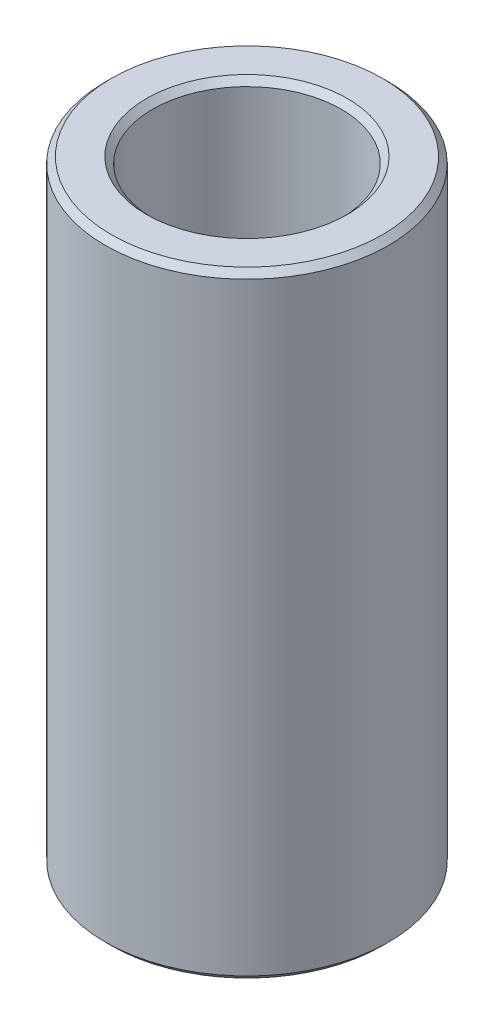
ISO-10303-21;
HEADER;
FILE_DESCRIPTION(('STEP AP214'),'2;1');
FILE_NAME('part.step','',(''),(''),'','','');
FILE_SCHEMA(('AUTOMOTIVE_DESIGN { 1 0 10303 214 1 1 1 1 }'));
ENDSEC;
DATA;
#1=APPLICATION_CONTEXT('core data for automotive mechanical design processes');
#2=APPLICATION_PROTOCOL_DEFINITION('international standard','automotive_design',2000,#1);
#3=PRODUCT_CONTEXT('',#1,'mechanical');
#4=PRODUCT('Part','Part','',(#3));
#5=PRODUCT_RELATED_PRODUCT_CATEGORY('part','',(#4));
#6=PRODUCT_DEFINITION_FORMATION('','',#4);
#7=PRODUCT_DEFINITION_CONTEXT('part definition',#1,'design');
#8=PRODUCT_DEFINITION('design','',#6,#7);
#9=PRODUCT_DEFINITION_SHAPE('','',#8);
#10=(LENGTH_UNIT() NAMED_UNIT(*) SI_UNIT(.MILLI.,.METRE.));
#11=(NAMED_UNIT(*) PLANE_ANGLE_UNIT() SI_UNIT($,.RADIAN.));
#12=(NAMED_UNIT(*) SI_UNIT($,.STERADIAN.) SOLID_ANGLE_UNIT());
#13=UNCERTAINTY_MEASURE_WITH_UNIT(LENGTH_MEASURE(1.E-05),#10,'distance_accuracy_value','');
#14=(GEOMETRIC_REPRESENTATION_CONTEXT(3) GLOBAL_UNCERTAINTY_ASSIGNED_CONTEXT((#13)) GLOBAL_UNIT_ASSIGNED_CONTEXT((#10,
#11,#12)) REPRESENTATION_CONTEXT('',''));
#15=CARTESIAN_POINT('',(0.,0.,0.));
#16=DIRECTION('',(0.,0.,1.));
#17=DIRECTION('',(1.,0.,0.));
#18=AXIS2_PLACEMENT_3D('',#15,#16,#17);
#19=CARTESIAN_POINT('',(0.,260.79511713479,0.));
#20=DIRECTION('',(0.,-1.,0.));
#21=DIRECTION('',(0.,0.,-1.));
#22=AXIS2_PLACEMENT_3D('',#19,#20,#21);
#23=CYLINDRICAL_SURFACE('',#22,60.);
#24=CARTESIAN_POINT('',(0.,2.6123615955207,0.));
#25=DIRECTION('',(0.,1.,0.));
#26=DIRECTION('',(0.,0.,1.));
#27=AXIS2_PLACEMENT_3D('',#24,#25,#26);
#28=CIRCLE('',#27,60.);
#29=CARTESIAN_POINT('',(0.,2.6123615955207,60.));
#30=VERTEX_POINT('',#29);
#31=EDGE_CURVE('E10',#30,#30,#28,.T.);
#32=ORIENTED_EDGE('',*,*,#31,.T.);
#33=EDGE_LOOP('',(#32));
#34=FACE_BOUND('',#33,.T.);
#35=CARTESIAN_POINT('',(0.,258.182755539269,0.));
#36=DIRECTION('',(0.,1.,0.));
#37=DIRECTION('',(0.,0.,1.));
#38=AXIS2_PLACEMENT_3D('',#35,#36,#37);
#39=CIRCLE('',#38,60.);
#40=CARTESIAN_POINT('',(0.,258.182755539269,60.));
#41=VERTEX_POINT('',#40);
#42=EDGE_CURVE('E50',#41,#41,#39,.F.);
#43=ORIENTED_EDGE('',*,*,#42,.T.);
#44=EDGE_LOOP('',(#43));
#45=FACE_BOUND('',#44,.T.);
#46=ADVANCED_FACE('F39',(#34,#45),#23,.T.);
#47=CARTESIAN_POINT('',(0.,260.79511713479,0.));
#48=DIRECTION('',(0.,1.,0.));
#49=DIRECTION('',(0.,0.,1.));
#50=AXIS2_PLACEMENT_3D('',#47,#48,#49);
#51=PLANE('',#50);
#52=CARTESIAN_POINT('',(0.,260.79511713479,0.));
#53=DIRECTION('',(0.,1.,0.));
#54=DIRECTION('',(0.,0.,1.));
#55=AXIS2_PLACEMENT_3D('',#52,#53,#54);
#56=CIRCLE('',#55,42.5654511295374);
#57=CARTESIAN_POINT('',(0.,260.79511713479,42.5654511295374));
#58=VERTEX_POINT('',#57);
#59=EDGE_CURVE('E58',#58,#58,#56,.F.);
#60=ORIENTED_EDGE('',*,*,#59,.T.);
#61=EDGE_LOOP('',(#60));
#62=FACE_BOUND('',#61,.T.);
#63=CARTESIAN_POINT('',(0.,260.79511713479,0.));
#64=DIRECTION('',(0.,1.,0.));
#65=DIRECTION('',(0.,0.,1.));
#66=AXIS2_PLACEMENT_3D('',#63,#64,#65);
#67=CIRCLE('',#66,57.3876384044793);
#68=CARTESIAN_POINT('',(0.,260.79511713479,57.3876384044793));
#69=VERTEX_POINT('',#68);
#70=EDGE_CURVE('E61',#69,#69,#67,.T.);
#71=ORIENTED_EDGE('',*,*,#70,.T.);
#72=EDGE_LOOP('',(#71));
#73=FACE_BOUND('',#72,.T.);
#74=ADVANCED_FACE('F88',(#62,#73),#51,.T.);
#75=CARTESIAN_POINT('',(0.,0.,0.));
#76=DIRECTION('',(0.,1.,0.));
#77=DIRECTION('',(0.,0.,1.));
#78=AXIS2_PLACEMENT_3D('',#75,#76,#77);
#79=PLANE('',#78);
#80=CARTESIAN_POINT('',(0.,0.,0.));
#81=DIRECTION('',(0.,1.,0.));
#82=DIRECTION('',(0.,0.,1.));
#83=AXIS2_PLACEMENT_3D('',#80,#81,#82);
#84=CIRCLE('',#83,42.5654511295373);
#85=CARTESIAN_POINT('',(0.,0.,42.5654511295373));
#86=VERTEX_POINT('',#85);
#87=EDGE_CURVE('E51',#86,#86,#84,.T.);
#88=ORIENTED_EDGE('',*,*,#87,.T.);
#89=EDGE_LOOP('',(#88));
#90=FACE_BOUND('',#89,.T.);
#91=CARTESIAN_POINT('',(0.,0.,0.));
#92=DIRECTION('',(0.,1.,0.));
#93=DIRECTION('',(0.,0.,1.));
#94=AXIS2_PLACEMENT_3D('',#91,#92,#93);
#95=CIRCLE('',#94,57.3876384044793);
#96=CARTESIAN_POINT('',(0.,0.,57.3876384044793));
#97=VERTEX_POINT('',#96);
#98=EDGE_CURVE('E54',#97,#97,#95,.F.);
#99=ORIENTED_EDGE('',*,*,#98,.T.);
#100=EDGE_LOOP('',(#99));
#101=FACE_BOUND('',#100,.T.);
#102=ADVANCED_FACE('F83',(#90,#101),#79,.F.);
#103=CARTESIAN_POINT('',(0.,260.79511713479,0.));
#104=DIRECTION('',(0.,-1.,0.));
#105=DIRECTION('',(0.,0.,-1.));
#106=AXIS2_PLACEMENT_3D('',#103,#104,#105);
#107=CYLINDRICAL_SURFACE('',#106,39.9530895340167);
#108=CARTESIAN_POINT('',(0.,258.18275553927,0.));
#109=DIRECTION('',(0.,1.,0.));
#110=DIRECTION('',(0.,0.,1.));
#111=AXIS2_PLACEMENT_3D('',#108,#109,#110);
#112=CIRCLE('',#111,39.9530895340167);
#113=CARTESIAN_POINT('',(0.,258.18275553927,39.9530895340167));
#114=VERTEX_POINT('',#113);
#115=EDGE_CURVE('E67',#114,#114,#112,.T.);
#116=ORIENTED_EDGE('',*,*,#115,.T.);
#117=EDGE_LOOP('',(#116));
#118=FACE_BOUND('',#117,.T.);
#119=CARTESIAN_POINT('',(0.,2.6123615955207,0.));
#120=DIRECTION('',(0.,1.,0.));
#121=DIRECTION('',(0.,0.,1.));
#122=AXIS2_PLACEMENT_3D('',#119,#120,#121);
#123=CIRCLE('',#122,39.9530895340167);
#124=CARTESIAN_POINT('',(0.,2.6123615955207,39.9530895340167));
#125=VERTEX_POINT('',#124);
#126=EDGE_CURVE('E69',#125,#125,#123,.F.);
#127=ORIENTED_EDGE('',*,*,#126,.T.);
#128=EDGE_LOOP('',(#127));
#129=FACE_BOUND('',#128,.T.);
#130=ADVANCED_FACE('F71',(#118,#129),#107,.F.);
#131=CARTESIAN_POINT('',(0.,258.18275553927,0.));
#132=DIRECTION('',(0.,1.,0.));
#133=DIRECTION('',(0.,0.,1.));
#134=AXIS2_PLACEMENT_3D('',#131,#132,#133);
#135=CONICAL_SURFACE('',#134,39.9530895340167,0.78539816339745);
#136=ORIENTED_EDGE('',*,*,#59,.F.);
#137=EDGE_LOOP('',(#136));
#138=FACE_BOUND('',#137,.T.);
#139=ORIENTED_EDGE('',*,*,#115,.F.);
#140=EDGE_LOOP('',(#139));
#141=FACE_BOUND('',#140,.T.);
#142=ADVANCED_FACE('F77',(#138,#141),#135,.F.);
#143=CARTESIAN_POINT('',(0.,0.,0.));
#144=DIRECTION('',(0.,-1.,0.));
#145=DIRECTION('',(0.,0.,-1.));
#146=AXIS2_PLACEMENT_3D('',#143,#144,#145);
#147=CONICAL_SURFACE('',#146,42.5654511295373,0.785398163397444);
#148=ORIENTED_EDGE('',*,*,#126,.F.);
#149=EDGE_LOOP('',(#148));
#150=FACE_BOUND('',#149,.T.);
#151=ORIENTED_EDGE('',*,*,#87,.F.);
#152=EDGE_LOOP('',(#151));
#153=FACE_BOUND('',#152,.T.);
#154=ADVANCED_FACE('F73',(#150,#153),#147,.F.);
#155=CARTESIAN_POINT('',(0.,2.6123615955207,0.));
#156=DIRECTION('',(0.,1.,0.));
#157=DIRECTION('',(0.,0.,1.));
#158=AXIS2_PLACEMENT_3D('',#155,#156,#157);
#159=CONICAL_SURFACE('',#158,60.,0.785398163397448);
#160=ORIENTED_EDGE('',*,*,#98,.F.);
#161=EDGE_LOOP('',(#160));
#162=FACE_BOUND('',#161,.T.);
#163=ORIENTED_EDGE('',*,*,#31,.F.);
#164=EDGE_LOOP('',(#163));
#165=FACE_BOUND('',#164,.T.);
#166=ADVANCED_FACE('F76',(#162,#165),#159,.T.);
#167=CARTESIAN_POINT('',(0.,260.79511713479,0.));
#168=DIRECTION('',(0.,-1.,0.));
#169=DIRECTION('',(0.,0.,-1.));
#170=AXIS2_PLACEMENT_3D('',#167,#168,#169);
#171=CONICAL_SURFACE('',#170,57.3876384044793,0.785398163397443);
#172=ORIENTED_EDGE('',*,*,#42,.F.);
#173=EDGE_LOOP('',(#172));
#174=FACE_BOUND('',#173,.T.);
#175=ORIENTED_EDGE('',*,*,#70,.F.);
#176=EDGE_LOOP('',(#175));
#177=FACE_BOUND('',#176,.T.);
#178=ADVANCED_FACE('F45',(#174,#177),#171,.T.);
#179=CLOSED_SHELL('',(#46,#74,#102,#130,#142,#154,#166,#178));
#180=MANIFOLD_SOLID_BREP('B2',#179);
#181=ADVANCED_BREP_SHAPE_REPRESENTATION('',(#18,#180),#14);
#182=SHAPE_DEFINITION_REPRESENTATION(#9,#181);
ENDSEC;
END-ISO-10303-21;
